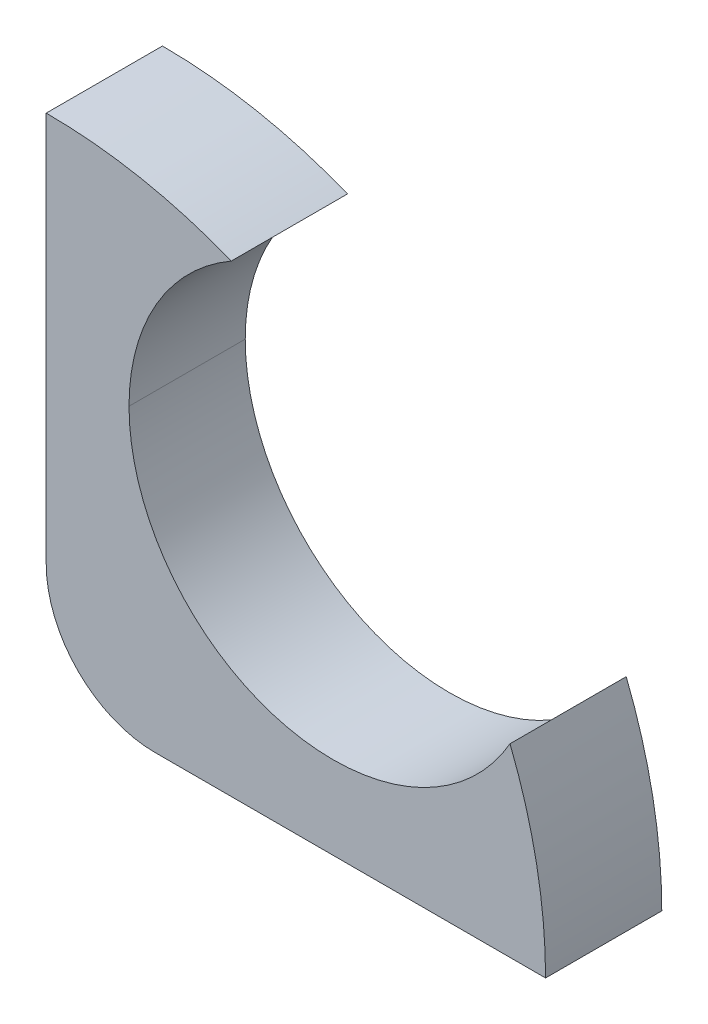
ISO-10303-21;
HEADER;
FILE_DESCRIPTION(('STEP AP214'),'2;1');
FILE_NAME('part.step','',(''),(''),'','','');
FILE_SCHEMA(('AUTOMOTIVE_DESIGN { 1 0 10303 214 1 1 1 1 }'));
ENDSEC;
DATA;
#1=APPLICATION_CONTEXT('core data for automotive mechanical design processes');
#2=APPLICATION_PROTOCOL_DEFINITION('international standard','automotive_design',2000,#1);
#3=PRODUCT_CONTEXT('',#1,'mechanical');
#4=PRODUCT('Part','Part','',(#3));
#5=PRODUCT_RELATED_PRODUCT_CATEGORY('part','',(#4));
#6=PRODUCT_DEFINITION_FORMATION('','',#4);
#7=PRODUCT_DEFINITION_CONTEXT('part definition',#1,'design');
#8=PRODUCT_DEFINITION('design','',#6,#7);
#9=PRODUCT_DEFINITION_SHAPE('','',#8);
#10=(LENGTH_UNIT() NAMED_UNIT(*) SI_UNIT(.MILLI.,.METRE.));
#11=(NAMED_UNIT(*) PLANE_ANGLE_UNIT() SI_UNIT($,.RADIAN.));
#12=(NAMED_UNIT(*) SI_UNIT($,.STERADIAN.) SOLID_ANGLE_UNIT());
#13=UNCERTAINTY_MEASURE_WITH_UNIT(LENGTH_MEASURE(1.E-05),#10,'distance_accuracy_value','');
#14=(GEOMETRIC_REPRESENTATION_CONTEXT(3) GLOBAL_UNCERTAINTY_ASSIGNED_CONTEXT((#13)) GLOBAL_UNIT_ASSIGNED_CONTEXT((#10,
#11,#12)) REPRESENTATION_CONTEXT('',''));
#15=CARTESIAN_POINT('',(0.,0.,0.));
#16=DIRECTION('',(0.,0.,1.));
#17=DIRECTION('',(1.,0.,0.));
#18=AXIS2_PLACEMENT_3D('',#15,#16,#17);
#19=CARTESIAN_POINT('',(-18.45,-18.45,18.95));
#20=DIRECTION('',(0.,0.,1.));
#21=DIRECTION('',(1.,0.,0.));
#22=AXIS2_PLACEMENT_3D('',#19,#20,#21);
#23=PLANE('',#22);
#24=CARTESIAN_POINT('',(-18.45,-18.45,18.95));
#25=DIRECTION('',(0.,0.,1.));
#26=DIRECTION('',(1.,0.,0.));
#27=AXIS2_PLACEMENT_3D('',#24,#25,#26);
#28=CIRCLE('',#27,1.5);
#29=CARTESIAN_POINT('',(-19.95,-18.45,18.95));
#30=VERTEX_POINT('',#29);
#31=CARTESIAN_POINT('',(-18.45,-19.95,18.95));
#32=VERTEX_POINT('',#31);
#33=EDGE_CURVE('E109',#30,#32,#28,.T.);
#34=ORIENTED_EDGE('',*,*,#33,.F.);
#35=DIRECTION('',(0.,-1.,0.));
#36=VECTOR('',#35,1.);
#37=CARTESIAN_POINT('',(-19.95,-13.075,18.95));
#38=LINE('',#37,#36);
#39=CARTESIAN_POINT('',(-19.95,-13.075,18.95));
#40=VERTEX_POINT('',#39);
#41=EDGE_CURVE('E26',#40,#30,#38,.T.);
#42=ORIENTED_EDGE('',*,*,#41,.F.);
#43=CARTESIAN_POINT('',(-19.95,-19.95,18.95));
#44=DIRECTION('',(0.,0.,1.));
#45=DIRECTION('',(1.,0.,0.));
#46=AXIS2_PLACEMENT_3D('',#43,#44,#45);
#47=CIRCLE('',#46,6.875);
#48=CARTESIAN_POINT('',(-17.4018583423997,-13.5646574803851,18.95));
#49=VERTEX_POINT('',#48);
#50=EDGE_CURVE('E147',#49,#40,#47,.T.);
#51=ORIENTED_EDGE('',*,*,#50,.F.);
#52=CARTESIAN_POINT('',(-16.,-16.,18.95));
#53=DIRECTION('',(0.,0.,-1.));
#54=DIRECTION('',(1.,0.,0.));
#55=AXIS2_PLACEMENT_3D('',#52,#53,#54);
#56=CIRCLE('',#55,2.81);
#57=CARTESIAN_POINT('',(-18.81,-16.,18.95));
#58=VERTEX_POINT('',#57);
#59=EDGE_CURVE('E133',#58,#49,#56,.T.);
#60=ORIENTED_EDGE('',*,*,#59,.F.);
#61=CARTESIAN_POINT('',(-16.,-16.,18.95));
#62=DIRECTION('',(0.,0.,-1.));
#63=DIRECTION('',(1.,0.,0.));
#64=AXIS2_PLACEMENT_3D('',#61,#62,#63);
#65=CIRCLE('',#64,2.81);
#66=CARTESIAN_POINT('',(-13.5646574803851,-17.4018583423997,18.95));
#67=VERTEX_POINT('',#66);
#68=EDGE_CURVE('E144',#67,#58,#65,.T.);
#69=ORIENTED_EDGE('',*,*,#68,.F.);
#70=CARTESIAN_POINT('',(-19.95,-19.95,18.95));
#71=DIRECTION('',(0.,0.,1.));
#72=DIRECTION('',(1.,0.,0.));
#73=AXIS2_PLACEMENT_3D('',#70,#71,#72);
#74=CIRCLE('',#73,6.875);
#75=CARTESIAN_POINT('',(-13.075,-19.95,18.95));
#76=VERTEX_POINT('',#75);
#77=EDGE_CURVE('E97',#76,#67,#74,.T.);
#78=ORIENTED_EDGE('',*,*,#77,.F.);
#79=DIRECTION('',(1.,0.,0.));
#80=VECTOR('',#79,1.);
#81=CARTESIAN_POINT('',(-18.45,-19.95,18.95));
#82=LINE('',#81,#80);
#83=EDGE_CURVE('E124',#32,#76,#82,.T.);
#84=ORIENTED_EDGE('',*,*,#83,.F.);
#85=EDGE_LOOP('',(#34,#42,#51,#60,#69,#78,#84));
#86=FACE_BOUND('',#85,.T.);
#87=ADVANCED_FACE('F16',(#86),#23,.F.);
#88=CARTESIAN_POINT('',(-18.45,-18.45,20.55));
#89=DIRECTION('',(0.,0.,1.));
#90=DIRECTION('',(1.,0.,0.));
#91=AXIS2_PLACEMENT_3D('',#88,#89,#90);
#92=PLANE('',#91);
#93=CARTESIAN_POINT('',(-18.45,-18.45,20.55));
#94=DIRECTION('',(0.,0.,1.));
#95=DIRECTION('',(1.,0.,0.));
#96=AXIS2_PLACEMENT_3D('',#93,#94,#95);
#97=CIRCLE('',#96,1.5);
#98=CARTESIAN_POINT('',(-19.95,-18.45,20.55));
#99=VERTEX_POINT('',#98);
#100=CARTESIAN_POINT('',(-18.45,-19.95,20.55));
#101=VERTEX_POINT('',#100);
#102=EDGE_CURVE('E100',#99,#101,#97,.T.);
#103=ORIENTED_EDGE('',*,*,#102,.T.);
#104=DIRECTION('',(1.,0.,0.));
#105=VECTOR('',#104,1.);
#106=CARTESIAN_POINT('',(-18.45,-19.95,20.55));
#107=LINE('',#106,#105);
#108=CARTESIAN_POINT('',(-13.075,-19.95,20.55));
#109=VERTEX_POINT('',#108);
#110=EDGE_CURVE('E85',#101,#109,#107,.T.);
#111=ORIENTED_EDGE('',*,*,#110,.T.);
#112=CARTESIAN_POINT('',(-19.95,-19.95,20.55));
#113=DIRECTION('',(0.,0.,1.));
#114=DIRECTION('',(1.,0.,0.));
#115=AXIS2_PLACEMENT_3D('',#112,#113,#114);
#116=CIRCLE('',#115,6.875);
#117=CARTESIAN_POINT('',(-13.5646574803851,-17.4018583423997,20.55));
#118=VERTEX_POINT('',#117);
#119=EDGE_CURVE('E132',#109,#118,#116,.T.);
#120=ORIENTED_EDGE('',*,*,#119,.T.);
#121=CARTESIAN_POINT('',(-16.,-16.,20.55));
#122=DIRECTION('',(0.,0.,-1.));
#123=DIRECTION('',(1.,0.,0.));
#124=AXIS2_PLACEMENT_3D('',#121,#122,#123);
#125=CIRCLE('',#124,2.81);
#126=CARTESIAN_POINT('',(-18.81,-16.,20.55));
#127=VERTEX_POINT('',#126);
#128=EDGE_CURVE('E140',#118,#127,#125,.T.);
#129=ORIENTED_EDGE('',*,*,#128,.T.);
#130=CARTESIAN_POINT('',(-16.,-16.,20.55));
#131=DIRECTION('',(0.,0.,-1.));
#132=DIRECTION('',(1.,0.,0.));
#133=AXIS2_PLACEMENT_3D('',#130,#131,#132);
#134=CIRCLE('',#133,2.81);
#135=CARTESIAN_POINT('',(-17.4018583423997,-13.5646574803851,20.55));
#136=VERTEX_POINT('',#135);
#137=EDGE_CURVE('E118',#127,#136,#134,.T.);
#138=ORIENTED_EDGE('',*,*,#137,.T.);
#139=CARTESIAN_POINT('',(-19.95,-19.95,20.55));
#140=DIRECTION('',(0.,0.,1.));
#141=DIRECTION('',(1.,0.,0.));
#142=AXIS2_PLACEMENT_3D('',#139,#140,#141);
#143=CIRCLE('',#142,6.875);
#144=CARTESIAN_POINT('',(-19.95,-13.075,20.55));
#145=VERTEX_POINT('',#144);
#146=EDGE_CURVE('E154',#136,#145,#143,.T.);
#147=ORIENTED_EDGE('',*,*,#146,.T.);
#148=DIRECTION('',(0.,-1.,0.));
#149=VECTOR('',#148,1.);
#150=CARTESIAN_POINT('',(-19.95,-13.075,20.55));
#151=LINE('',#150,#149);
#152=EDGE_CURVE('E11',#145,#99,#151,.T.);
#153=ORIENTED_EDGE('',*,*,#152,.T.);
#154=EDGE_LOOP('',(#103,#111,#120,#129,#138,#147,#153));
#155=FACE_BOUND('',#154,.T.);
#156=ADVANCED_FACE('F101',(#155),#92,.T.);
#157=CARTESIAN_POINT('',(-19.95,-13.075,20.55));
#158=DIRECTION('',(1.,0.,0.));
#159=DIRECTION('',(0.,1.,0.));
#160=AXIS2_PLACEMENT_3D('',#157,#158,#159);
#161=PLANE('',#160);
#162=ORIENTED_EDGE('',*,*,#41,.T.);
#163=DIRECTION('',(0.,0.,-1.));
#164=VECTOR('',#163,1.);
#165=CARTESIAN_POINT('',(-19.95,-18.45,20.55));
#166=LINE('',#165,#164);
#167=EDGE_CURVE('E105',#99,#30,#166,.T.);
#168=ORIENTED_EDGE('',*,*,#167,.F.);
#169=ORIENTED_EDGE('',*,*,#152,.F.);
#170=DIRECTION('',(0.,0.,-1.));
#171=VECTOR('',#170,1.);
#172=CARTESIAN_POINT('',(-19.95,-13.075,20.55));
#173=LINE('',#172,#171);
#174=EDGE_CURVE('E151',#145,#40,#173,.T.);
#175=ORIENTED_EDGE('',*,*,#174,.T.);
#176=EDGE_LOOP('',(#162,#168,#169,#175));
#177=FACE_BOUND('',#176,.T.);
#178=ADVANCED_FACE('F174',(#177),#161,.F.);
#179=CARTESIAN_POINT('',(-19.95,-19.95,20.55));
#180=DIRECTION('',(0.,0.,-1.));
#181=DIRECTION('',(-1.,0.,0.));
#182=AXIS2_PLACEMENT_3D('',#179,#180,#181);
#183=CYLINDRICAL_SURFACE('',#182,6.875);
#184=ORIENTED_EDGE('',*,*,#50,.T.);
#185=ORIENTED_EDGE('',*,*,#174,.F.);
#186=ORIENTED_EDGE('',*,*,#146,.F.);
#187=DIRECTION('',(0.,0.,-1.));
#188=VECTOR('',#187,1.);
#189=CARTESIAN_POINT('',(-17.4018583423997,-13.5646574803851,20.55));
#190=LINE('',#189,#188);
#191=EDGE_CURVE('E19',#136,#49,#190,.T.);
#192=ORIENTED_EDGE('',*,*,#191,.T.);
#193=EDGE_LOOP('',(#184,#185,#186,#192));
#194=FACE_BOUND('',#193,.T.);
#195=ADVANCED_FACE('F170',(#194),#183,.T.);
#196=CARTESIAN_POINT('',(-16.,-16.,20.55));
#197=DIRECTION('',(0.,0.,-1.));
#198=DIRECTION('',(-1.,0.,0.));
#199=AXIS2_PLACEMENT_3D('',#196,#197,#198);
#200=CYLINDRICAL_SURFACE('',#199,2.81);
#201=DIRECTION('',(0.,0.,-1.));
#202=VECTOR('',#201,1.);
#203=CARTESIAN_POINT('',(-18.81,-16.,20.55));
#204=LINE('',#203,#202);
#205=EDGE_CURVE('E121',#127,#58,#204,.T.);
#206=ORIENTED_EDGE('',*,*,#205,.F.);
#207=ORIENTED_EDGE('',*,*,#128,.F.);
#208=DIRECTION('',(0.,0.,-1.));
#209=VECTOR('',#208,1.);
#210=CARTESIAN_POINT('',(-13.5646574803851,-17.4018583423997,20.55));
#211=LINE('',#210,#209);
#212=EDGE_CURVE('E128',#118,#67,#211,.T.);
#213=ORIENTED_EDGE('',*,*,#212,.T.);
#214=ORIENTED_EDGE('',*,*,#68,.T.);
#215=EDGE_LOOP('',(#206,#207,#213,#214));
#216=FACE_BOUND('',#215,.T.);
#217=ADVANCED_FACE('F182',(#216),#200,.F.);
#218=CARTESIAN_POINT('',(-19.95,-19.95,20.55));
#219=DIRECTION('',(0.,0.,-1.));
#220=DIRECTION('',(-1.,0.,0.));
#221=AXIS2_PLACEMENT_3D('',#218,#219,#220);
#222=CYLINDRICAL_SURFACE('',#221,6.875);
#223=ORIENTED_EDGE('',*,*,#77,.T.);
#224=ORIENTED_EDGE('',*,*,#212,.F.);
#225=ORIENTED_EDGE('',*,*,#119,.F.);
#226=DIRECTION('',(0.,0.,-1.));
#227=VECTOR('',#226,1.);
#228=CARTESIAN_POINT('',(-13.075,-19.95,20.55));
#229=LINE('',#228,#227);
#230=EDGE_CURVE('E93',#109,#76,#229,.T.);
#231=ORIENTED_EDGE('',*,*,#230,.T.);
#232=EDGE_LOOP('',(#223,#224,#225,#231));
#233=FACE_BOUND('',#232,.T.);
#234=ADVANCED_FACE('F224',(#233),#222,.T.);
#235=CARTESIAN_POINT('',(-18.45,-19.95,20.55));
#236=DIRECTION('',(0.,1.,0.));
#237=DIRECTION('',(1.,0.,0.));
#238=AXIS2_PLACEMENT_3D('',#235,#236,#237);
#239=PLANE('',#238);
#240=ORIENTED_EDGE('',*,*,#83,.T.);
#241=ORIENTED_EDGE('',*,*,#230,.F.);
#242=ORIENTED_EDGE('',*,*,#110,.F.);
#243=DIRECTION('',(0.,0.,-1.));
#244=VECTOR('',#243,1.);
#245=CARTESIAN_POINT('',(-18.45,-19.95,20.55));
#246=LINE('',#245,#244);
#247=EDGE_CURVE('E90',#101,#32,#246,.T.);
#248=ORIENTED_EDGE('',*,*,#247,.T.);
#249=EDGE_LOOP('',(#240,#241,#242,#248));
#250=FACE_BOUND('',#249,.T.);
#251=ADVANCED_FACE('F88',(#250),#239,.F.);
#252=CARTESIAN_POINT('',(-18.45,-18.45,20.55));
#253=DIRECTION('',(0.,0.,-1.));
#254=DIRECTION('',(-1.,0.,0.));
#255=AXIS2_PLACEMENT_3D('',#252,#253,#254);
#256=CYLINDRICAL_SURFACE('',#255,1.5);
#257=ORIENTED_EDGE('',*,*,#33,.T.);
#258=ORIENTED_EDGE('',*,*,#247,.F.);
#259=ORIENTED_EDGE('',*,*,#102,.F.);
#260=ORIENTED_EDGE('',*,*,#167,.T.);
#261=EDGE_LOOP('',(#257,#258,#259,#260));
#262=FACE_BOUND('',#261,.T.);
#263=ADVANCED_FACE('F107',(#262),#256,.T.);
#264=CARTESIAN_POINT('',(-16.,-16.,20.55));
#265=DIRECTION('',(0.,0.,-1.));
#266=DIRECTION('',(-1.,0.,0.));
#267=AXIS2_PLACEMENT_3D('',#264,#265,#266);
#268=CYLINDRICAL_SURFACE('',#267,2.81);
#269=ORIENTED_EDGE('',*,*,#137,.F.);
#270=ORIENTED_EDGE('',*,*,#205,.T.);
#271=ORIENTED_EDGE('',*,*,#59,.T.);
#272=ORIENTED_EDGE('',*,*,#191,.F.);
#273=EDGE_LOOP('',(#269,#270,#271,#272));
#274=FACE_BOUND('',#273,.T.);
#275=ADVANCED_FACE('F253',(#274),#268,.F.);
#276=CLOSED_SHELL('',(#87,#156,#178,#195,#217,#234,#251,#263,#275));
#277=MANIFOLD_SOLID_BREP('B1',#276);
#278=ADVANCED_BREP_SHAPE_REPRESENTATION('',(#18,#277),#14);
#279=SHAPE_DEFINITION_REPRESENTATION(#9,#278);
ENDSEC;
END-ISO-10303-21;
